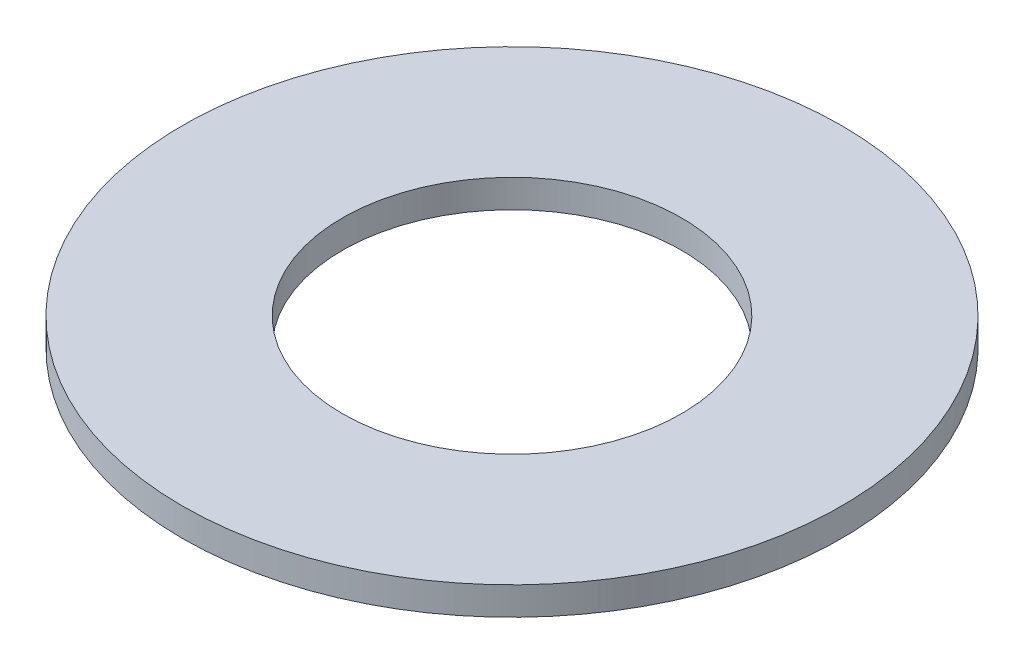
ISO-10303-21;
HEADER;
FILE_DESCRIPTION(('STEP AP214'),'2;1');
FILE_NAME('part.step','',(''),(''),'','','');
FILE_SCHEMA(('AUTOMOTIVE_DESIGN { 1 0 10303 214 1 1 1 1 }'));
ENDSEC;
DATA;
#1=APPLICATION_CONTEXT('core data for automotive mechanical design processes');
#2=APPLICATION_PROTOCOL_DEFINITION('international standard','automotive_design',2000,#1);
#3=PRODUCT_CONTEXT('',#1,'mechanical');
#4=PRODUCT('Part','Part','',(#3));
#5=PRODUCT_RELATED_PRODUCT_CATEGORY('part','',(#4));
#6=PRODUCT_DEFINITION_FORMATION('','',#4);
#7=PRODUCT_DEFINITION_CONTEXT('part definition',#1,'design');
#8=PRODUCT_DEFINITION('design','',#6,#7);
#9=PRODUCT_DEFINITION_SHAPE('','',#8);
#10=(LENGTH_UNIT() NAMED_UNIT(*) SI_UNIT(.MILLI.,.METRE.));
#11=(NAMED_UNIT(*) PLANE_ANGLE_UNIT() SI_UNIT($,.RADIAN.));
#12=(NAMED_UNIT(*) SI_UNIT($,.STERADIAN.) SOLID_ANGLE_UNIT());
#13=UNCERTAINTY_MEASURE_WITH_UNIT(LENGTH_MEASURE(1.E-05),#10,'distance_accuracy_value','');
#14=(GEOMETRIC_REPRESENTATION_CONTEXT(3) GLOBAL_UNCERTAINTY_ASSIGNED_CONTEXT((#13)) GLOBAL_UNIT_ASSIGNED_CONTEXT((#10,
#11,#12)) REPRESENTATION_CONTEXT('',''));
#15=CARTESIAN_POINT('',(0.,0.,0.));
#16=DIRECTION('',(0.,0.,1.));
#17=DIRECTION('',(1.,0.,0.));
#18=AXIS2_PLACEMENT_3D('',#15,#16,#17);
#19=CARTESIAN_POINT('',(0.,0.4064,0.));
#20=DIRECTION('',(0.,1.,0.));
#21=DIRECTION('',(0.,0.,1.));
#22=AXIS2_PLACEMENT_3D('',#19,#20,#21);
#23=PLANE('',#22);
#24=CARTESIAN_POINT('',(0.,0.4064,0.));
#25=DIRECTION('',(0.,1.,0.));
#26=DIRECTION('',(0.,0.,1.));
#27=AXIS2_PLACEMENT_3D('',#24,#25,#26);
#28=CIRCLE('',#27,4.7625);
#29=CARTESIAN_POINT('',(0.,0.4064,4.7625));
#30=VERTEX_POINT('',#29);
#31=EDGE_CURVE('E10',#30,#30,#28,.T.);
#32=ORIENTED_EDGE('',*,*,#31,.T.);
#33=EDGE_LOOP('',(#32));
#34=FACE_BOUND('',#33,.T.);
#35=CARTESIAN_POINT('',(0.,0.4064,0.));
#36=DIRECTION('',(0.,1.,0.));
#37=DIRECTION('',(0.,0.,1.));
#38=AXIS2_PLACEMENT_3D('',#35,#36,#37);
#39=CIRCLE('',#38,2.4511);
#40=CARTESIAN_POINT('',(0.,0.4064,2.4511));
#41=VERTEX_POINT('',#40);
#42=EDGE_CURVE('E44',#41,#41,#39,.T.);
#43=ORIENTED_EDGE('',*,*,#42,.F.);
#44=EDGE_LOOP('',(#43));
#45=FACE_BOUND('',#44,.T.);
#46=ADVANCED_FACE('F33',(#34,#45),#23,.T.);
#47=CARTESIAN_POINT('',(0.,0.,0.));
#48=DIRECTION('',(0.,1.,0.));
#49=DIRECTION('',(0.,0.,1.));
#50=AXIS2_PLACEMENT_3D('',#47,#48,#49);
#51=PLANE('',#50);
#52=CARTESIAN_POINT('',(0.,0.,0.));
#53=DIRECTION('',(0.,1.,0.));
#54=DIRECTION('',(0.,0.,1.));
#55=AXIS2_PLACEMENT_3D('',#52,#53,#54);
#56=CIRCLE('',#55,4.7625);
#57=CARTESIAN_POINT('',(0.,0.,4.7625));
#58=VERTEX_POINT('',#57);
#59=EDGE_CURVE('E37',#58,#58,#56,.T.);
#60=ORIENTED_EDGE('',*,*,#59,.F.);
#61=EDGE_LOOP('',(#60));
#62=FACE_BOUND('',#61,.T.);
#63=CARTESIAN_POINT('',(0.,0.,0.));
#64=DIRECTION('',(0.,1.,0.));
#65=DIRECTION('',(0.,0.,1.));
#66=AXIS2_PLACEMENT_3D('',#63,#64,#65);
#67=CIRCLE('',#66,2.4511);
#68=CARTESIAN_POINT('',(0.,0.,2.4511));
#69=VERTEX_POINT('',#68);
#70=EDGE_CURVE('E46',#69,#69,#67,.T.);
#71=ORIENTED_EDGE('',*,*,#70,.T.);
#72=EDGE_LOOP('',(#71));
#73=FACE_BOUND('',#72,.T.);
#74=ADVANCED_FACE('F56',(#62,#73),#51,.F.);
#75=CARTESIAN_POINT('',(0.,0.4064,0.));
#76=DIRECTION('',(0.,-1.,0.));
#77=DIRECTION('',(0.,0.,-1.));
#78=AXIS2_PLACEMENT_3D('',#75,#76,#77);
#79=CYLINDRICAL_SURFACE('',#78,4.7625);
#80=ORIENTED_EDGE('',*,*,#31,.F.);
#81=EDGE_LOOP('',(#80));
#82=FACE_BOUND('',#81,.T.);
#83=ORIENTED_EDGE('',*,*,#59,.T.);
#84=EDGE_LOOP('',(#83));
#85=FACE_BOUND('',#84,.T.);
#86=ADVANCED_FACE('F35',(#82,#85),#79,.T.);
#87=CARTESIAN_POINT('',(0.,0.4064,0.));
#88=DIRECTION('',(0.,-1.,0.));
#89=DIRECTION('',(0.,0.,-1.));
#90=AXIS2_PLACEMENT_3D('',#87,#88,#89);
#91=CYLINDRICAL_SURFACE('',#90,2.4511);
#92=ORIENTED_EDGE('',*,*,#42,.T.);
#93=EDGE_LOOP('',(#92));
#94=FACE_BOUND('',#93,.T.);
#95=ORIENTED_EDGE('',*,*,#70,.F.);
#96=EDGE_LOOP('',(#95));
#97=FACE_BOUND('',#96,.T.);
#98=ADVANCED_FACE('F52',(#94,#97),#91,.F.);
#99=CLOSED_SHELL('',(#46,#74,#86,#98));
#100=MANIFOLD_SOLID_BREP('B2',#99);
#101=ADVANCED_BREP_SHAPE_REPRESENTATION('',(#18,#100),#14);
#102=SHAPE_DEFINITION_REPRESENTATION(#9,#101);
ENDSEC;
END-ISO-10303-21;
